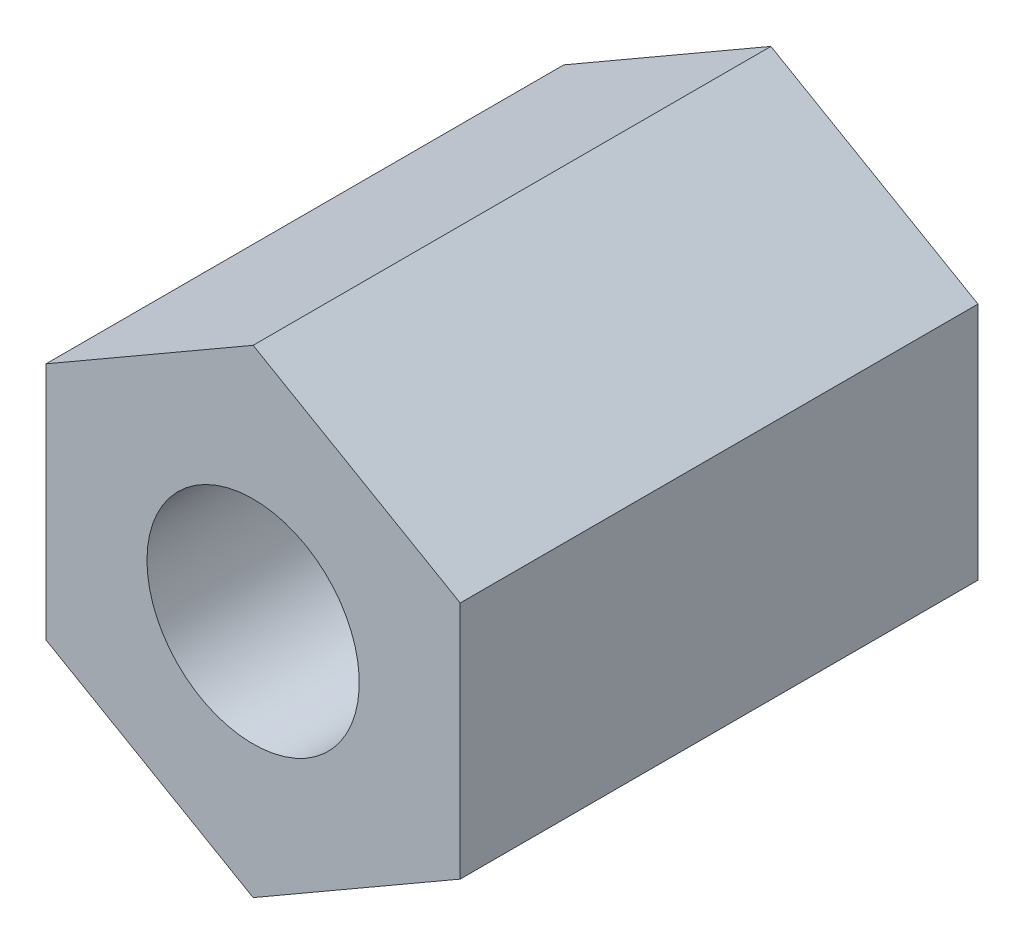
ISO-10303-21;
HEADER;
FILE_DESCRIPTION(('STEP AP214'),'2;1');
FILE_NAME('part.step','',(''),(''),'','','');
FILE_SCHEMA(('AUTOMOTIVE_DESIGN { 1 0 10303 214 1 1 1 1 }'));
ENDSEC;
DATA;
#1=APPLICATION_CONTEXT('core data for automotive mechanical design processes');
#2=APPLICATION_PROTOCOL_DEFINITION('international standard','automotive_design',2000,#1);
#3=PRODUCT_CONTEXT('',#1,'mechanical');
#4=PRODUCT('Part','Part','',(#3));
#5=PRODUCT_RELATED_PRODUCT_CATEGORY('part','',(#4));
#6=PRODUCT_DEFINITION_FORMATION('','',#4);
#7=PRODUCT_DEFINITION_CONTEXT('part definition',#1,'design');
#8=PRODUCT_DEFINITION('design','',#6,#7);
#9=PRODUCT_DEFINITION_SHAPE('','',#8);
#10=(LENGTH_UNIT() NAMED_UNIT(*) SI_UNIT(.MILLI.,.METRE.));
#11=(NAMED_UNIT(*) PLANE_ANGLE_UNIT() SI_UNIT($,.RADIAN.));
#12=(NAMED_UNIT(*) SI_UNIT($,.STERADIAN.) SOLID_ANGLE_UNIT());
#13=UNCERTAINTY_MEASURE_WITH_UNIT(LENGTH_MEASURE(1.E-05),#10,'distance_accuracy_value','');
#14=(GEOMETRIC_REPRESENTATION_CONTEXT(3) GLOBAL_UNCERTAINTY_ASSIGNED_CONTEXT((#13)) GLOBAL_UNIT_ASSIGNED_CONTEXT((#10,
#11,#12)) REPRESENTATION_CONTEXT('',''));
#15=CARTESIAN_POINT('',(0.,0.,0.));
#16=DIRECTION('',(0.,0.,1.));
#17=DIRECTION('',(1.,0.,0.));
#18=AXIS2_PLACEMENT_3D('',#15,#16,#17);
#19=CARTESIAN_POINT('',(0.,-2.3094010767585,0.));
#20=DIRECTION('',(0.,0.,1.));
#21=DIRECTION('',(1.,0.,0.));
#22=AXIS2_PLACEMENT_3D('',#19,#20,#21);
#23=PLANE('',#22);
#24=DIRECTION('',(0.866025403784438,-0.5,0.));
#25=VECTOR('',#24,1.);
#26=CARTESIAN_POINT('',(-2.,-1.15470053837925,0.));
#27=LINE('',#26,#25);
#28=CARTESIAN_POINT('',(-2.,-1.15470053837925,0.));
#29=VERTEX_POINT('',#28);
#30=CARTESIAN_POINT('',(0.,-2.3094010767585,0.));
#31=VERTEX_POINT('',#30);
#32=EDGE_CURVE('E117',#29,#31,#27,.T.);
#33=ORIENTED_EDGE('',*,*,#32,.F.);
#34=DIRECTION('',(0.,-1.,0.));
#35=VECTOR('',#34,1.);
#36=CARTESIAN_POINT('',(-2.,1.15470053837925,0.));
#37=LINE('',#36,#35);
#38=CARTESIAN_POINT('',(-2.,1.15470053837925,0.));
#39=VERTEX_POINT('',#38);
#40=EDGE_CURVE('E78',#39,#29,#37,.T.);
#41=ORIENTED_EDGE('',*,*,#40,.F.);
#42=DIRECTION('',(-0.866025403784438,-0.5,0.));
#43=VECTOR('',#42,1.);
#44=CARTESIAN_POINT('',(0.,2.3094010767585,0.));
#45=LINE('',#44,#43);
#46=CARTESIAN_POINT('',(0.,2.3094010767585,0.));
#47=VERTEX_POINT('',#46);
#48=EDGE_CURVE('E72',#47,#39,#45,.T.);
#49=ORIENTED_EDGE('',*,*,#48,.F.);
#50=DIRECTION('',(-0.866025403784439,0.5,0.));
#51=VECTOR('',#50,1.);
#52=CARTESIAN_POINT('',(2.,1.15470053837926,0.));
#53=LINE('',#52,#51);
#54=CARTESIAN_POINT('',(2.,1.15470053837926,0.));
#55=VERTEX_POINT('',#54);
#56=EDGE_CURVE('E107',#55,#47,#53,.T.);
#57=ORIENTED_EDGE('',*,*,#56,.F.);
#58=DIRECTION('',(0.,1.,0.));
#59=VECTOR('',#58,1.);
#60=CARTESIAN_POINT('',(2.,-1.15470053837925,0.));
#61=LINE('',#60,#59);
#62=CARTESIAN_POINT('',(2.,-1.15470053837925,0.));
#63=VERTEX_POINT('',#62);
#64=EDGE_CURVE('E123',#63,#55,#61,.T.);
#65=ORIENTED_EDGE('',*,*,#64,.F.);
#66=DIRECTION('',(0.866025403784438,0.5,0.));
#67=VECTOR('',#66,1.);
#68=CARTESIAN_POINT('',(0.,-2.3094010767585,0.));
#69=LINE('',#68,#67);
#70=EDGE_CURVE('E120',#31,#63,#69,.T.);
#71=ORIENTED_EDGE('',*,*,#70,.F.);
#72=EDGE_LOOP('',(#33,#41,#49,#57,#65,#71));
#73=FACE_BOUND('',#72,.T.);
#74=CARTESIAN_POINT('',(0.,0.,0.));
#75=DIRECTION('',(0.,0.,-1.));
#76=DIRECTION('',(-1.,0.,0.));
#77=AXIS2_PLACEMENT_3D('',#74,#75,#76);
#78=CIRCLE('',#77,1.02499999999999);
#79=CARTESIAN_POINT('',(-1.02499999999999,0.,0.));
#80=VERTEX_POINT('',#79);
#81=EDGE_CURVE('E168',#80,#80,#78,.T.);
#82=ORIENTED_EDGE('',*,*,#81,.F.);
#83=EDGE_LOOP('',(#82));
#84=FACE_BOUND('',#83,.T.);
#85=ADVANCED_FACE('F32',(#73,#84),#23,.F.);
#86=CARTESIAN_POINT('',(-2.,-1.15470053837925,5.));
#87=DIRECTION('',(0.5,0.866025403784438,0.));
#88=DIRECTION('',(-0.866025403784439,0.5,0.));
#89=AXIS2_PLACEMENT_3D('',#86,#87,#88);
#90=PLANE('',#89);
#91=ORIENTED_EDGE('',*,*,#32,.T.);
#92=DIRECTION('',(0.,0.,-1.));
#93=VECTOR('',#92,1.);
#94=CARTESIAN_POINT('',(0.,-2.3094010767585,5.));
#95=LINE('',#94,#93);
#96=CARTESIAN_POINT('',(0.,-2.3094010767585,5.));
#97=VERTEX_POINT('',#96);
#98=EDGE_CURVE('E11',#97,#31,#95,.T.);
#99=ORIENTED_EDGE('',*,*,#98,.F.);
#100=DIRECTION('',(0.866025403784438,-0.5,0.));
#101=VECTOR('',#100,1.);
#102=CARTESIAN_POINT('',(-2.,-1.15470053837925,5.));
#103=LINE('',#102,#101);
#104=CARTESIAN_POINT('',(-2.,-1.15470053837925,5.));
#105=VERTEX_POINT('',#104);
#106=EDGE_CURVE('E128',#105,#97,#103,.T.);
#107=ORIENTED_EDGE('',*,*,#106,.F.);
#108=DIRECTION('',(0.,0.,-1.));
#109=VECTOR('',#108,1.);
#110=CARTESIAN_POINT('',(-2.,-1.15470053837925,5.));
#111=LINE('',#110,#109);
#112=EDGE_CURVE('E113',#105,#29,#111,.T.);
#113=ORIENTED_EDGE('',*,*,#112,.T.);
#114=EDGE_LOOP('',(#91,#99,#107,#113));
#115=FACE_BOUND('',#114,.T.);
#116=ADVANCED_FACE('F34',(#115),#90,.F.);
#117=CARTESIAN_POINT('',(0.,-2.3094010767585,5.));
#118=DIRECTION('',(-0.5,0.866025403784438,0.));
#119=DIRECTION('',(-0.866025403784438,-0.5,0.));
#120=AXIS2_PLACEMENT_3D('',#117,#118,#119);
#121=PLANE('',#120);
#122=ORIENTED_EDGE('',*,*,#70,.T.);
#123=DIRECTION('',(0.,0.,-1.));
#124=VECTOR('',#123,1.);
#125=CARTESIAN_POINT('',(2.,-1.15470053837925,5.));
#126=LINE('',#125,#124);
#127=CARTESIAN_POINT('',(2.,-1.15470053837925,5.));
#128=VERTEX_POINT('',#127);
#129=EDGE_CURVE('E41',#128,#63,#126,.T.);
#130=ORIENTED_EDGE('',*,*,#129,.F.);
#131=DIRECTION('',(0.866025403784438,0.5,0.));
#132=VECTOR('',#131,1.);
#133=CARTESIAN_POINT('',(0.,-2.3094010767585,5.));
#134=LINE('',#133,#132);
#135=EDGE_CURVE('E86',#97,#128,#134,.T.);
#136=ORIENTED_EDGE('',*,*,#135,.F.);
#137=ORIENTED_EDGE('',*,*,#98,.T.);
#138=EDGE_LOOP('',(#122,#130,#136,#137));
#139=FACE_BOUND('',#138,.T.);
#140=ADVANCED_FACE('F157',(#139),#121,.F.);
#141=CARTESIAN_POINT('',(2.,-1.15470053837925,5.));
#142=DIRECTION('',(-1.,0.,0.));
#143=DIRECTION('',(0.,-1.,0.));
#144=AXIS2_PLACEMENT_3D('',#141,#142,#143);
#145=PLANE('',#144);
#146=ORIENTED_EDGE('',*,*,#64,.T.);
#147=DIRECTION('',(0.,0.,-1.));
#148=VECTOR('',#147,1.);
#149=CARTESIAN_POINT('',(2.,1.15470053837926,5.));
#150=LINE('',#149,#148);
#151=CARTESIAN_POINT('',(2.,1.15470053837926,5.));
#152=VERTEX_POINT('',#151);
#153=EDGE_CURVE('E108',#152,#55,#150,.T.);
#154=ORIENTED_EDGE('',*,*,#153,.F.);
#155=DIRECTION('',(0.,1.,0.));
#156=VECTOR('',#155,1.);
#157=CARTESIAN_POINT('',(2.,-1.15470053837925,5.));
#158=LINE('',#157,#156);
#159=EDGE_CURVE('E99',#128,#152,#158,.T.);
#160=ORIENTED_EDGE('',*,*,#159,.F.);
#161=ORIENTED_EDGE('',*,*,#129,.T.);
#162=EDGE_LOOP('',(#146,#154,#160,#161));
#163=FACE_BOUND('',#162,.T.);
#164=ADVANCED_FACE('F134',(#163),#145,.F.);
#165=CARTESIAN_POINT('',(2.,1.15470053837926,5.));
#166=DIRECTION('',(-0.5,-0.866025403784439,0.));
#167=DIRECTION('',(0.866025403784439,-0.5,0.));
#168=AXIS2_PLACEMENT_3D('',#165,#166,#167);
#169=PLANE('',#168);
#170=ORIENTED_EDGE('',*,*,#56,.T.);
#171=DIRECTION('',(0.,0.,-1.));
#172=VECTOR('',#171,1.);
#173=CARTESIAN_POINT('',(0.,2.3094010767585,5.));
#174=LINE('',#173,#172);
#175=CARTESIAN_POINT('',(0.,2.3094010767585,5.));
#176=VERTEX_POINT('',#175);
#177=EDGE_CURVE('E104',#176,#47,#174,.T.);
#178=ORIENTED_EDGE('',*,*,#177,.F.);
#179=DIRECTION('',(-0.866025403784439,0.5,0.));
#180=VECTOR('',#179,1.);
#181=CARTESIAN_POINT('',(2.,1.15470053837926,5.));
#182=LINE('',#181,#180);
#183=EDGE_CURVE('E93',#152,#176,#182,.T.);
#184=ORIENTED_EDGE('',*,*,#183,.F.);
#185=ORIENTED_EDGE('',*,*,#153,.T.);
#186=EDGE_LOOP('',(#170,#178,#184,#185));
#187=FACE_BOUND('',#186,.T.);
#188=ADVANCED_FACE('F105',(#187),#169,.F.);
#189=CARTESIAN_POINT('',(0.,2.3094010767585,5.));
#190=DIRECTION('',(0.5,-0.866025403784438,0.));
#191=DIRECTION('',(0.866025403784439,0.5,0.));
#192=AXIS2_PLACEMENT_3D('',#189,#190,#191);
#193=PLANE('',#192);
#194=ORIENTED_EDGE('',*,*,#48,.T.);
#195=DIRECTION('',(0.,0.,-1.));
#196=VECTOR('',#195,1.);
#197=CARTESIAN_POINT('',(-2.,1.15470053837925,5.));
#198=LINE('',#197,#196);
#199=CARTESIAN_POINT('',(-2.,1.15470053837925,5.));
#200=VERTEX_POINT('',#199);
#201=EDGE_CURVE('E109',#200,#39,#198,.T.);
#202=ORIENTED_EDGE('',*,*,#201,.F.);
#203=DIRECTION('',(-0.866025403784438,-0.5,0.));
#204=VECTOR('',#203,1.);
#205=CARTESIAN_POINT('',(0.,2.3094010767585,5.));
#206=LINE('',#205,#204);
#207=EDGE_CURVE('E97',#176,#200,#206,.T.);
#208=ORIENTED_EDGE('',*,*,#207,.F.);
#209=ORIENTED_EDGE('',*,*,#177,.T.);
#210=EDGE_LOOP('',(#194,#202,#208,#209));
#211=FACE_BOUND('',#210,.T.);
#212=ADVANCED_FACE('F111',(#211),#193,.F.);
#213=CARTESIAN_POINT('',(-2.,1.15470053837925,5.));
#214=DIRECTION('',(1.,0.,0.));
#215=DIRECTION('',(0.,0.,-1.));
#216=AXIS2_PLACEMENT_3D('',#213,#214,#215);
#217=PLANE('',#216);
#218=ORIENTED_EDGE('',*,*,#40,.T.);
#219=ORIENTED_EDGE('',*,*,#112,.F.);
#220=DIRECTION('',(0.,-1.,0.));
#221=VECTOR('',#220,1.);
#222=CARTESIAN_POINT('',(-2.,1.15470053837925,5.));
#223=LINE('',#222,#221);
#224=EDGE_CURVE('E49',#200,#105,#223,.T.);
#225=ORIENTED_EDGE('',*,*,#224,.F.);
#226=ORIENTED_EDGE('',*,*,#201,.T.);
#227=EDGE_LOOP('',(#218,#219,#225,#226));
#228=FACE_BOUND('',#227,.T.);
#229=ADVANCED_FACE('F141',(#228),#217,.F.);
#230=CARTESIAN_POINT('',(0.,-2.3094010767585,5.));
#231=DIRECTION('',(0.,0.,1.));
#232=DIRECTION('',(1.,0.,0.));
#233=AXIS2_PLACEMENT_3D('',#230,#231,#232);
#234=PLANE('',#233);
#235=CARTESIAN_POINT('',(0.,0.,5.));
#236=DIRECTION('',(0.,0.,-1.));
#237=DIRECTION('',(-1.,0.,0.));
#238=AXIS2_PLACEMENT_3D('',#235,#236,#237);
#239=CIRCLE('',#238,1.025);
#240=CARTESIAN_POINT('',(-1.025,0.,5.));
#241=VERTEX_POINT('',#240);
#242=EDGE_CURVE('E121',#241,#241,#239,.T.);
#243=ORIENTED_EDGE('',*,*,#242,.T.);
#244=EDGE_LOOP('',(#243));
#245=FACE_BOUND('',#244,.T.);
#246=ORIENTED_EDGE('',*,*,#106,.T.);
#247=ORIENTED_EDGE('',*,*,#135,.T.);
#248=ORIENTED_EDGE('',*,*,#159,.T.);
#249=ORIENTED_EDGE('',*,*,#183,.T.);
#250=ORIENTED_EDGE('',*,*,#207,.T.);
#251=ORIENTED_EDGE('',*,*,#224,.T.);
#252=EDGE_LOOP('',(#246,#247,#248,#249,#250,#251));
#253=FACE_BOUND('',#252,.T.);
#254=ADVANCED_FACE('F95',(#245,#253),#234,.T.);
#255=CARTESIAN_POINT('',(0.,0.,0.));
#256=DIRECTION('',(0.,0.,-1.));
#257=DIRECTION('',(-1.,0.,0.));
#258=AXIS2_PLACEMENT_3D('',#255,#256,#257);
#259=CYLINDRICAL_SURFACE('',#258,1.02499999999999);
#260=ORIENTED_EDGE('',*,*,#242,.F.);
#261=EDGE_LOOP('',(#260));
#262=FACE_BOUND('',#261,.T.);
#263=ORIENTED_EDGE('',*,*,#81,.T.);
#264=EDGE_LOOP('',(#263));
#265=FACE_BOUND('',#264,.T.);
#266=ADVANCED_FACE('F148',(#262,#265),#259,.F.);
#267=CLOSED_SHELL('',(#85,#116,#140,#164,#188,#212,#229,#254,#266));
#268=MANIFOLD_SOLID_BREP('B2',#267);
#269=ADVANCED_BREP_SHAPE_REPRESENTATION('',(#18,#268),#14);
#270=SHAPE_DEFINITION_REPRESENTATION(#9,#269);
ENDSEC;
END-ISO-10303-21;
